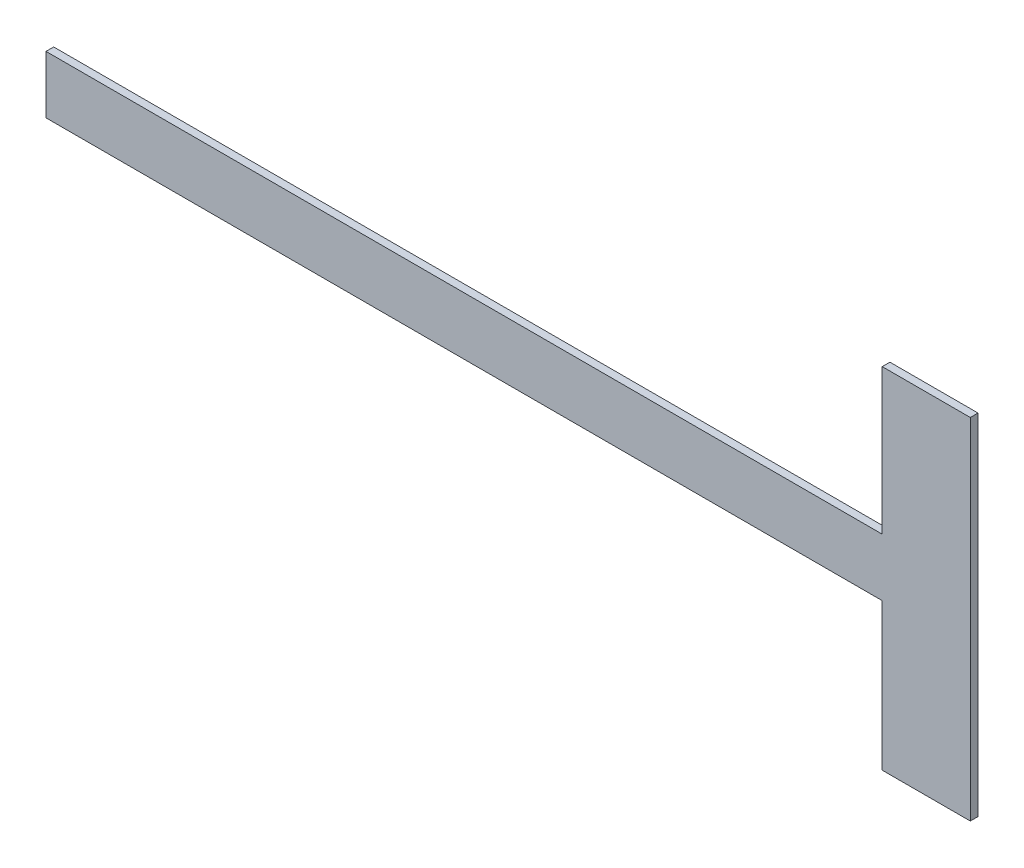
ISO-10303-21;
HEADER;
FILE_DESCRIPTION(('STEP AP214'),'2;1');
FILE_NAME('part.step','',(''),(''),'','','');
FILE_SCHEMA(('AUTOMOTIVE_DESIGN { 1 0 10303 214 1 1 1 1 }'));
ENDSEC;
DATA;
#1=APPLICATION_CONTEXT('core data for automotive mechanical design processes');
#2=APPLICATION_PROTOCOL_DEFINITION('international standard','automotive_design',2000,#1);
#3=PRODUCT_CONTEXT('',#1,'mechanical');
#4=PRODUCT('Part','Part','',(#3));
#5=PRODUCT_RELATED_PRODUCT_CATEGORY('part','',(#4));
#6=PRODUCT_DEFINITION_FORMATION('','',#4);
#7=PRODUCT_DEFINITION_CONTEXT('part definition',#1,'design');
#8=PRODUCT_DEFINITION('design','',#6,#7);
#9=PRODUCT_DEFINITION_SHAPE('','',#8);
#10=(LENGTH_UNIT() NAMED_UNIT(*) SI_UNIT(.MILLI.,.METRE.));
#11=(NAMED_UNIT(*) PLANE_ANGLE_UNIT() SI_UNIT($,.RADIAN.));
#12=(NAMED_UNIT(*) SI_UNIT($,.STERADIAN.) SOLID_ANGLE_UNIT());
#13=UNCERTAINTY_MEASURE_WITH_UNIT(LENGTH_MEASURE(1.E-05),#10,'distance_accuracy_value','');
#14=(GEOMETRIC_REPRESENTATION_CONTEXT(3) GLOBAL_UNCERTAINTY_ASSIGNED_CONTEXT((#13)) GLOBAL_UNIT_ASSIGNED_CONTEXT((#10,
#11,#12)) REPRESENTATION_CONTEXT('',''));
#15=CARTESIAN_POINT('',(0.,0.,0.));
#16=DIRECTION('',(0.,0.,1.));
#17=DIRECTION('',(1.,0.,0.));
#18=AXIS2_PLACEMENT_3D('',#15,#16,#17);
#19=CARTESIAN_POINT('',(186.200114357348,125.342180707238,5.95));
#20=DIRECTION('',(0.,0.,1.));
#21=DIRECTION('',(1.,0.,0.));
#22=AXIS2_PLACEMENT_3D('',#19,#20,#21);
#23=PLANE('',#22);
#24=DIRECTION('',(1.,0.,0.));
#25=VECTOR('',#24,1.);
#26=CARTESIAN_POINT('',(186.200114357348,125.715924036879,5.95));
#27=LINE('',#26,#25);
#28=CARTESIAN_POINT('',(197.056548747657,125.715924036879,5.95));
#29=VERTEX_POINT('',#28);
#30=CARTESIAN_POINT('',(186.200114357348,125.715924036879,5.95));
#31=VERTEX_POINT('',#30);
#32=EDGE_CURVE('E127',#29,#31,#27,.F.);
#33=ORIENTED_EDGE('',*,*,#32,.F.);
#34=DIRECTION('',(0.,1.,0.));
#35=VECTOR('',#34,1.);
#36=CARTESIAN_POINT('',(197.056548747657,125.715924036879,5.95));
#37=LINE('',#36,#35);
#38=CARTESIAN_POINT('',(197.056548747657,127.6,5.95));
#39=VERTEX_POINT('',#38);
#40=EDGE_CURVE('E122',#39,#29,#37,.F.);
#41=ORIENTED_EDGE('',*,*,#40,.F.);
#42=DIRECTION('',(1.,0.,0.));
#43=VECTOR('',#42,1.);
#44=CARTESIAN_POINT('',(197.056548747657,127.6,5.95));
#45=LINE('',#44,#43);
#46=CARTESIAN_POINT('',(198.200000000001,127.6,5.95));
#47=VERTEX_POINT('',#46);
#48=EDGE_CURVE('E116',#47,#39,#45,.F.);
#49=ORIENTED_EDGE('',*,*,#48,.F.);
#50=DIRECTION('',(0.,1.,0.));
#51=VECTOR('',#50,1.);
#52=CARTESIAN_POINT('',(198.200000000001,127.6,5.95));
#53=LINE('',#52,#51);
#54=CARTESIAN_POINT('',(198.200000000001,123.062175737375,5.95));
#55=VERTEX_POINT('',#54);
#56=EDGE_CURVE('E110',#55,#47,#53,.T.);
#57=ORIENTED_EDGE('',*,*,#56,.F.);
#58=DIRECTION('',(1.,0.,0.));
#59=VECTOR('',#58,1.);
#60=CARTESIAN_POINT('',(198.200000000001,123.062175737375,5.95));
#61=LINE('',#60,#59);
#62=CARTESIAN_POINT('',(197.056548747657,123.062175737375,5.95));
#63=VERTEX_POINT('',#62);
#64=EDGE_CURVE('E104',#63,#55,#61,.T.);
#65=ORIENTED_EDGE('',*,*,#64,.F.);
#66=DIRECTION('',(0.,1.,0.));
#67=VECTOR('',#66,1.);
#68=CARTESIAN_POINT('',(197.056548747657,123.062175737375,5.95));
#69=LINE('',#68,#67);
#70=CARTESIAN_POINT('',(197.056548747657,124.968437377597,5.95));
#71=VERTEX_POINT('',#70);
#72=EDGE_CURVE('E80',#71,#63,#69,.F.);
#73=ORIENTED_EDGE('',*,*,#72,.F.);
#74=DIRECTION('',(1.,0.,0.));
#75=VECTOR('',#74,1.);
#76=CARTESIAN_POINT('',(197.056548747657,124.968437377597,5.95));
#77=LINE('',#76,#75);
#78=CARTESIAN_POINT('',(186.200114357348,124.968437377597,5.95));
#79=VERTEX_POINT('',#78);
#80=EDGE_CURVE('E82',#79,#71,#77,.T.);
#81=ORIENTED_EDGE('',*,*,#80,.F.);
#82=DIRECTION('',(0.,1.,0.));
#83=VECTOR('',#82,1.);
#84=CARTESIAN_POINT('',(186.200114357348,124.968437377597,5.95));
#85=LINE('',#84,#83);
#86=EDGE_CURVE('E20',#31,#79,#85,.F.);
#87=ORIENTED_EDGE('',*,*,#86,.F.);
#88=EDGE_LOOP('',(#33,#41,#49,#57,#65,#73,#81,#87));
#89=FACE_BOUND('',#88,.T.);
#90=ADVANCED_FACE('F17',(#89),#23,.F.);
#91=CARTESIAN_POINT('',(186.200114357348,124.968437377597,6.05));
#92=DIRECTION('',(-1.,0.,0.));
#93=DIRECTION('',(0.,0.,1.));
#94=AXIS2_PLACEMENT_3D('',#91,#92,#93);
#95=PLANE('',#94);
#96=DIRECTION('',(0.,1.,0.));
#97=VECTOR('',#96,1.);
#98=CARTESIAN_POINT('',(186.200114357348,125.342180707238,6.05));
#99=LINE('',#98,#97);
#100=CARTESIAN_POINT('',(186.200114357348,125.715924036879,6.05));
#101=VERTEX_POINT('',#100);
#102=CARTESIAN_POINT('',(186.200114357348,124.968437377597,6.05));
#103=VERTEX_POINT('',#102);
#104=EDGE_CURVE('E131',#101,#103,#99,.F.);
#105=ORIENTED_EDGE('',*,*,#104,.F.);
#106=DIRECTION('',(0.,0.,1.));
#107=VECTOR('',#106,1.);
#108=CARTESIAN_POINT('',(186.200114357348,125.715924036879,6.05));
#109=LINE('',#108,#107);
#110=EDGE_CURVE('E93',#31,#101,#109,.T.);
#111=ORIENTED_EDGE('',*,*,#110,.F.);
#112=ORIENTED_EDGE('',*,*,#86,.T.);
#113=DIRECTION('',(0.,0.,-1.));
#114=VECTOR('',#113,1.);
#115=CARTESIAN_POINT('',(186.200114357348,124.968437377597,6.05));
#116=LINE('',#115,#114);
#117=EDGE_CURVE('E88',#103,#79,#116,.T.);
#118=ORIENTED_EDGE('',*,*,#117,.F.);
#119=EDGE_LOOP('',(#105,#111,#112,#118));
#120=FACE_BOUND('',#119,.T.);
#121=ADVANCED_FACE('F90',(#120),#95,.T.);
#122=CARTESIAN_POINT('',(197.056548747657,124.968437377597,6.05));
#123=DIRECTION('',(0.,-1.,0.));
#124=DIRECTION('',(0.,0.,-1.));
#125=AXIS2_PLACEMENT_3D('',#122,#123,#124);
#126=PLANE('',#125);
#127=DIRECTION('',(1.,0.,0.));
#128=VECTOR('',#127,1.);
#129=CARTESIAN_POINT('',(186.200114357348,124.968437377597,6.05));
#130=LINE('',#129,#128);
#131=CARTESIAN_POINT('',(197.056548747657,124.968437377597,6.05));
#132=VERTEX_POINT('',#131);
#133=EDGE_CURVE('E97',#103,#132,#130,.T.);
#134=ORIENTED_EDGE('',*,*,#133,.F.);
#135=ORIENTED_EDGE('',*,*,#117,.T.);
#136=ORIENTED_EDGE('',*,*,#80,.T.);
#137=DIRECTION('',(0.,0.,1.));
#138=VECTOR('',#137,1.);
#139=CARTESIAN_POINT('',(197.056548747657,124.968437377597,6.05));
#140=LINE('',#139,#138);
#141=EDGE_CURVE('E100',#132,#71,#140,.F.);
#142=ORIENTED_EDGE('',*,*,#141,.F.);
#143=EDGE_LOOP('',(#134,#135,#136,#142));
#144=FACE_BOUND('',#143,.T.);
#145=ADVANCED_FACE('F95',(#144),#126,.T.);
#146=CARTESIAN_POINT('',(197.056548747657,123.062175737375,6.05));
#147=DIRECTION('',(-1.,0.,0.));
#148=DIRECTION('',(0.,0.,1.));
#149=AXIS2_PLACEMENT_3D('',#146,#147,#148);
#150=PLANE('',#149);
#151=DIRECTION('',(0.,1.,0.));
#152=VECTOR('',#151,1.);
#153=CARTESIAN_POINT('',(197.056548747657,125.342180707238,6.05));
#154=LINE('',#153,#152);
#155=CARTESIAN_POINT('',(197.056548747657,123.062175737375,6.05));
#156=VERTEX_POINT('',#155);
#157=EDGE_CURVE('E134',#132,#156,#154,.F.);
#158=ORIENTED_EDGE('',*,*,#157,.F.);
#159=ORIENTED_EDGE('',*,*,#141,.T.);
#160=ORIENTED_EDGE('',*,*,#72,.T.);
#161=DIRECTION('',(0.,0.,-1.));
#162=VECTOR('',#161,1.);
#163=CARTESIAN_POINT('',(197.056548747657,123.062175737375,6.05));
#164=LINE('',#163,#162);
#165=EDGE_CURVE('E107',#156,#63,#164,.T.);
#166=ORIENTED_EDGE('',*,*,#165,.F.);
#167=EDGE_LOOP('',(#158,#159,#160,#166));
#168=FACE_BOUND('',#167,.T.);
#169=ADVANCED_FACE('F161',(#168),#150,.T.);
#170=CARTESIAN_POINT('',(198.200000000001,123.062175737375,6.05));
#171=DIRECTION('',(0.,-1.,0.));
#172=DIRECTION('',(0.,0.,-1.));
#173=AXIS2_PLACEMENT_3D('',#170,#171,#172);
#174=PLANE('',#173);
#175=DIRECTION('',(1.,0.,0.));
#176=VECTOR('',#175,1.);
#177=CARTESIAN_POINT('',(186.200114357348,123.062175737375,6.05));
#178=LINE('',#177,#176);
#179=CARTESIAN_POINT('',(198.200000000001,123.062175737375,6.05));
#180=VERTEX_POINT('',#179);
#181=EDGE_CURVE('E137',#156,#180,#178,.T.);
#182=ORIENTED_EDGE('',*,*,#181,.F.);
#183=ORIENTED_EDGE('',*,*,#165,.T.);
#184=ORIENTED_EDGE('',*,*,#64,.T.);
#185=DIRECTION('',(0.,0.,-1.));
#186=VECTOR('',#185,1.);
#187=CARTESIAN_POINT('',(198.200000000001,123.062175737375,6.05));
#188=LINE('',#187,#186);
#189=EDGE_CURVE('E113',#180,#55,#188,.T.);
#190=ORIENTED_EDGE('',*,*,#189,.F.);
#191=EDGE_LOOP('',(#182,#183,#184,#190));
#192=FACE_BOUND('',#191,.T.);
#193=ADVANCED_FACE('F158',(#192),#174,.T.);
#194=CARTESIAN_POINT('',(198.200000000001,127.6,6.05));
#195=DIRECTION('',(1.,0.,0.));
#196=DIRECTION('',(0.,0.,-1.));
#197=AXIS2_PLACEMENT_3D('',#194,#195,#196);
#198=PLANE('',#197);
#199=DIRECTION('',(0.,1.,0.));
#200=VECTOR('',#199,1.);
#201=CARTESIAN_POINT('',(198.200000000001,125.342180707238,6.05));
#202=LINE('',#201,#200);
#203=CARTESIAN_POINT('',(198.200000000001,127.6,6.05));
#204=VERTEX_POINT('',#203);
#205=EDGE_CURVE('E140',#180,#204,#202,.T.);
#206=ORIENTED_EDGE('',*,*,#205,.F.);
#207=ORIENTED_EDGE('',*,*,#189,.T.);
#208=ORIENTED_EDGE('',*,*,#56,.T.);
#209=DIRECTION('',(0.,0.,1.));
#210=VECTOR('',#209,1.);
#211=CARTESIAN_POINT('',(198.200000000001,127.6,6.05));
#212=LINE('',#211,#210);
#213=EDGE_CURVE('E119',#204,#47,#212,.F.);
#214=ORIENTED_EDGE('',*,*,#213,.F.);
#215=EDGE_LOOP('',(#206,#207,#208,#214));
#216=FACE_BOUND('',#215,.T.);
#217=ADVANCED_FACE('F155',(#216),#198,.T.);
#218=CARTESIAN_POINT('',(197.056548747657,127.6,6.05));
#219=DIRECTION('',(0.,1.,0.));
#220=DIRECTION('',(0.,0.,1.));
#221=AXIS2_PLACEMENT_3D('',#218,#219,#220);
#222=PLANE('',#221);
#223=DIRECTION('',(1.,0.,0.));
#224=VECTOR('',#223,1.);
#225=CARTESIAN_POINT('',(186.200114357348,127.6,6.05));
#226=LINE('',#225,#224);
#227=CARTESIAN_POINT('',(197.056548747657,127.6,6.05));
#228=VERTEX_POINT('',#227);
#229=EDGE_CURVE('E143',#204,#228,#226,.F.);
#230=ORIENTED_EDGE('',*,*,#229,.F.);
#231=ORIENTED_EDGE('',*,*,#213,.T.);
#232=ORIENTED_EDGE('',*,*,#48,.T.);
#233=DIRECTION('',(0.,0.,1.));
#234=VECTOR('',#233,1.);
#235=CARTESIAN_POINT('',(197.056548747657,127.6,6.05));
#236=LINE('',#235,#234);
#237=EDGE_CURVE('E124',#228,#39,#236,.F.);
#238=ORIENTED_EDGE('',*,*,#237,.F.);
#239=EDGE_LOOP('',(#230,#231,#232,#238));
#240=FACE_BOUND('',#239,.T.);
#241=ADVANCED_FACE('F152',(#240),#222,.T.);
#242=CARTESIAN_POINT('',(197.056548747657,125.715924036879,6.05));
#243=DIRECTION('',(-1.,0.,0.));
#244=DIRECTION('',(0.,0.,1.));
#245=AXIS2_PLACEMENT_3D('',#242,#243,#244);
#246=PLANE('',#245);
#247=DIRECTION('',(0.,1.,0.));
#248=VECTOR('',#247,1.);
#249=CARTESIAN_POINT('',(197.056548747657,125.342180707238,6.05));
#250=LINE('',#249,#248);
#251=CARTESIAN_POINT('',(197.056548747657,125.715924036879,6.05));
#252=VERTEX_POINT('',#251);
#253=EDGE_CURVE('E26',#228,#252,#250,.F.);
#254=ORIENTED_EDGE('',*,*,#253,.F.);
#255=ORIENTED_EDGE('',*,*,#237,.T.);
#256=ORIENTED_EDGE('',*,*,#40,.T.);
#257=DIRECTION('',(0.,0.,1.));
#258=VECTOR('',#257,1.);
#259=CARTESIAN_POINT('',(197.056548747657,125.715924036879,6.05));
#260=LINE('',#259,#258);
#261=EDGE_CURVE('E35',#252,#29,#260,.F.);
#262=ORIENTED_EDGE('',*,*,#261,.F.);
#263=EDGE_LOOP('',(#254,#255,#256,#262));
#264=FACE_BOUND('',#263,.T.);
#265=ADVANCED_FACE('F150',(#264),#246,.T.);
#266=CARTESIAN_POINT('',(186.200114357348,125.715924036879,6.05));
#267=DIRECTION('',(0.,1.,0.));
#268=DIRECTION('',(0.,0.,1.));
#269=AXIS2_PLACEMENT_3D('',#266,#267,#268);
#270=PLANE('',#269);
#271=DIRECTION('',(1.,0.,0.));
#272=VECTOR('',#271,1.);
#273=CARTESIAN_POINT('',(186.200114357348,125.715924036879,6.05));
#274=LINE('',#273,#272);
#275=EDGE_CURVE('E11',#252,#101,#274,.F.);
#276=ORIENTED_EDGE('',*,*,#275,.F.);
#277=ORIENTED_EDGE('',*,*,#261,.T.);
#278=ORIENTED_EDGE('',*,*,#32,.T.);
#279=ORIENTED_EDGE('',*,*,#110,.T.);
#280=EDGE_LOOP('',(#276,#277,#278,#279));
#281=FACE_BOUND('',#280,.T.);
#282=ADVANCED_FACE('F163',(#281),#270,.T.);
#283=CARTESIAN_POINT('',(186.200114357348,125.342180707238,6.05));
#284=DIRECTION('',(0.,0.,1.));
#285=DIRECTION('',(1.,0.,0.));
#286=AXIS2_PLACEMENT_3D('',#283,#284,#285);
#287=PLANE('',#286);
#288=ORIENTED_EDGE('',*,*,#253,.T.);
#289=ORIENTED_EDGE('',*,*,#275,.T.);
#290=ORIENTED_EDGE('',*,*,#104,.T.);
#291=ORIENTED_EDGE('',*,*,#133,.T.);
#292=ORIENTED_EDGE('',*,*,#157,.T.);
#293=ORIENTED_EDGE('',*,*,#181,.T.);
#294=ORIENTED_EDGE('',*,*,#205,.T.);
#295=ORIENTED_EDGE('',*,*,#229,.T.);
#296=EDGE_LOOP('',(#288,#289,#290,#291,#292,#293,#294,#295));
#297=FACE_BOUND('',#296,.T.);
#298=ADVANCED_FACE('F148',(#297),#287,.T.);
#299=CLOSED_SHELL('',(#90,#121,#145,#169,#193,#217,#241,#265,#282,#298));
#300=MANIFOLD_SOLID_BREP('B1',#299);
#301=ADVANCED_BREP_SHAPE_REPRESENTATION('',(#18,#300),#14);
#302=SHAPE_DEFINITION_REPRESENTATION(#9,#301);
ENDSEC;
END-ISO-10303-21;
